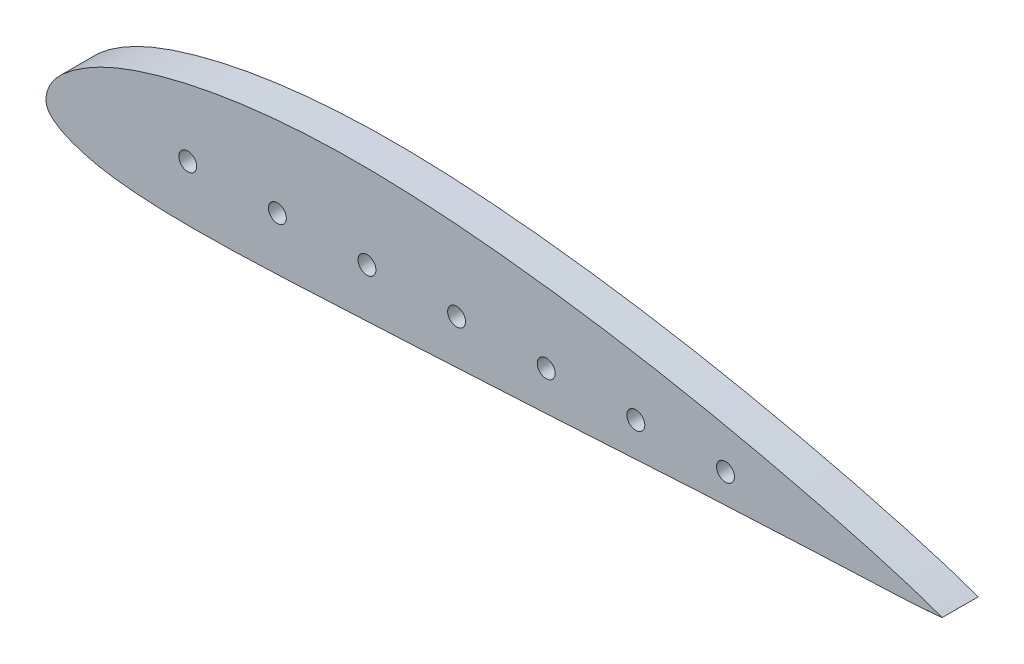
ISO-10303-21;
HEADER;
FILE_DESCRIPTION(('STEP AP214'),'2;1');
FILE_NAME('part.step','',(''),(''),'','','');
FILE_SCHEMA(('AUTOMOTIVE_DESIGN { 1 0 10303 214 1 1 1 1 }'));
ENDSEC;
DATA;
#1=APPLICATION_CONTEXT('core data for automotive mechanical design processes');
#2=APPLICATION_PROTOCOL_DEFINITION('international standard','automotive_design',2000,#1);
#3=PRODUCT_CONTEXT('',#1,'mechanical');
#4=PRODUCT('Part','Part','',(#3));
#5=PRODUCT_RELATED_PRODUCT_CATEGORY('part','',(#4));
#6=PRODUCT_DEFINITION_FORMATION('','',#4);
#7=PRODUCT_DEFINITION_CONTEXT('part definition',#1,'design');
#8=PRODUCT_DEFINITION('design','',#6,#7);
#9=PRODUCT_DEFINITION_SHAPE('','',#8);
#10=(LENGTH_UNIT() NAMED_UNIT(*) SI_UNIT(.MILLI.,.METRE.));
#11=(NAMED_UNIT(*) PLANE_ANGLE_UNIT() SI_UNIT($,.RADIAN.));
#12=(NAMED_UNIT(*) SI_UNIT($,.STERADIAN.) SOLID_ANGLE_UNIT());
#13=UNCERTAINTY_MEASURE_WITH_UNIT(LENGTH_MEASURE(1.E-05),#10,'distance_accuracy_value','');
#14=(GEOMETRIC_REPRESENTATION_CONTEXT(3) GLOBAL_UNCERTAINTY_ASSIGNED_CONTEXT((#13)) GLOBAL_UNIT_ASSIGNED_CONTEXT((#10,
#11,#12)) REPRESENTATION_CONTEXT('',''));
#15=CARTESIAN_POINT('',(0.,0.,0.));
#16=DIRECTION('',(0.,0.,1.));
#17=DIRECTION('',(1.,0.,0.));
#18=AXIS2_PLACEMENT_3D('',#15,#16,#17);
#19=CARTESIAN_POINT('',(109.451798245431,-5.08,5.08));
#20=CARTESIAN_POINT('',(109.454459178744,-5.0694258075468,5.08));
#21=CARTESIAN_POINT('',(109.156485113387,-4.98893370323383,5.08));
#22=CARTESIAN_POINT('',(108.862479978843,-4.85461195717568,5.08));
#23=CARTESIAN_POINT('',(108.123918831792,-4.60117460669964,5.08));
#24=CARTESIAN_POINT('',(107.210252378163,-4.27511376250752,5.08));
#25=CARTESIAN_POINT('',(105.996957401387,-3.86412804078641,5.08));
#26=CARTESIAN_POINT('',(104.53923708378,-3.39638968784611,5.08));
#27=CARTESIAN_POINT('',(102.825319980878,-2.87269416847168,5.08));
#28=CARTESIAN_POINT('',(100.868609031412,-2.30429498547947,5.08));
#29=CARTESIAN_POINT('',(98.677120018108,-1.68869250290389,5.08));
#30=CARTESIAN_POINT('',(96.2607696880802,-1.03022566798201,5.08));
#31=CARTESIAN_POINT('',(93.6287885564061,-0.338112688202309,5.08));
#32=CARTESIAN_POINT('',(90.7922213295436,0.379443625793548,5.08));
#33=CARTESIAN_POINT('',(87.763546501109,1.11431874333265,5.08));
#34=CARTESIAN_POINT('',(84.5564227101674,1.86229543610744,5.08));
#35=CARTESIAN_POINT('',(81.1839302502545,2.61699936289568,5.08));
#36=CARTESIAN_POINT('',(77.6604626634929,3.37053566938624,5.08));
#37=CARTESIAN_POINT('',(74.0010871470234,4.11297119869992,5.08));
#38=CARTESIAN_POINT('',(70.2214341758904,4.83293517068693,5.08));
#39=CARTESIAN_POINT('',(66.3383847064585,5.52614773239327,5.08));
#40=CARTESIAN_POINT('',(62.3677609232154,6.18164020219338,5.08));
#41=CARTESIAN_POINT('',(58.3265125103218,6.79467104657786,5.08));
#42=CARTESIAN_POINT('',(54.2322654270605,7.3581142754929,5.08));
#43=CARTESIAN_POINT('',(50.1022571746908,7.86521701869206,5.08));
#44=CARTESIAN_POINT('',(45.9552044921986,8.314460056631,5.08));
#45=CARTESIAN_POINT('',(41.8078837688901,8.69458239306826,5.08));
#46=CARTESIAN_POINT('',(37.6778363852409,8.99935984883897,5.08));
#47=CARTESIAN_POINT('',(33.5831190485169,9.21958181200142,5.08));
#48=CARTESIAN_POINT('',(29.5409359542949,9.34484403364536,5.08));
#49=CARTESIAN_POINT('',(25.5691488449866,9.36615166551586,5.08));
#50=CARTESIAN_POINT('',(21.6842898563108,9.28357115971868,5.08));
#51=CARTESIAN_POINT('',(17.9029694699595,9.09080508611618,5.08));
#52=CARTESIAN_POINT('',(14.2414370042572,8.7901066249628,5.08));
#53=CARTESIAN_POINT('',(10.7158433347186,8.38653772777966,5.08));
#54=CARTESIAN_POINT('',(7.34129415025395,7.8879080307597,5.08));
#55=CARTESIAN_POINT('',(4.13154087545609,7.30231347263919,5.08));
#56=CARTESIAN_POINT('',(1.10132100092707,6.62948617803047,5.08));
#57=CARTESIAN_POINT('',(-1.73752956384269,5.88532139130179,5.08));
#58=CARTESIAN_POINT('',(-4.37422419748082,5.08138202904439,5.08));
#59=CARTESIAN_POINT('',(-6.79803409663357,4.21512382907975,5.08));
#60=CARTESIAN_POINT('',(-8.99434944048081,3.2765844082489,5.08));
#61=CARTESIAN_POINT('',(-10.9551443346364,2.28063145613607,5.08));
#62=CARTESIAN_POINT('',(-12.6686354294678,1.24621608471318,5.08));
#63=CARTESIAN_POINT('',(-14.1399104434869,0.212705200843522,5.08));
#64=CARTESIAN_POINT('',(-15.3576774886313,-0.820744476133744,5.08));
#65=CARTESIAN_POINT('',(-16.3295875394342,-1.85673893959521,5.08));
#66=CARTESIAN_POINT('',(-17.0202628363783,-2.92281035826037,5.08));
#67=CARTESIAN_POINT('',(-17.4333115493092,-3.96809924516641,5.08));
#68=CARTESIAN_POINT('',(-17.5940544635785,-4.93610308833838,5.08));
#69=CARTESIAN_POINT('',(-17.4702175183407,-5.8088750473589,5.08));
#70=CARTESIAN_POINT('',(-17.0086699305709,-6.54105129294257,5.08));
#71=CARTESIAN_POINT('',(-16.2891353909068,-7.16046076096368,5.08));
#72=CARTESIAN_POINT('',(-15.3346647951794,-7.75507397664849,5.08));
#73=CARTESIAN_POINT('',(-14.1159134721564,-8.30420201060925,5.08));
#74=CARTESIAN_POINT('',(-12.6509130514106,-8.82509795076425,5.08));
#75=CARTESIAN_POINT('',(-10.9336053977492,-9.28593558990606,5.08));
#76=CARTESIAN_POINT('',(-8.97172749068822,-9.66043772730412,5.08));
#77=CARTESIAN_POINT('',(-6.77656462348316,-9.95195932071161,5.08));
#78=CARTESIAN_POINT('',(-4.35740448122734,-10.1686680412697,5.08));
#79=CARTESIAN_POINT('',(-1.72342073780623,-10.3101291264901,5.08));
#80=CARTESIAN_POINT('',(1.11440166995971,-10.3826502445106,5.08));
#81=CARTESIAN_POINT('',(4.14351152847955,-10.3925875239466,5.08));
#82=CARTESIAN_POINT('',(7.35101774838941,-10.3534470410694,5.08));
#83=CARTESIAN_POINT('',(10.7239168059759,-10.264224791165,5.08));
#84=CARTESIAN_POINT('',(14.2476307401474,-10.129211039176,5.08));
#85=CARTESIAN_POINT('',(17.9071565324739,-9.96369874462537,5.08));
#86=CARTESIAN_POINT('',(21.6864453218922,-9.77790103308645,5.08));
#87=CARTESIAN_POINT('',(25.5695768287591,-9.58317083590831,5.08));
#88=CARTESIAN_POINT('',(29.5400512381537,-9.38439462786708,5.08));
#89=CARTESIAN_POINT('',(33.5812406526052,-9.1804648701214,5.08));
#90=CARTESIAN_POINT('',(37.6753635670211,-8.97045350143588,5.08));
#91=CARTESIAN_POINT('',(41.8050014681156,-8.75232303328595,5.08));
#92=CARTESIAN_POINT('',(45.9520094179179,-8.52678932796871,5.08));
#93=CARTESIAN_POINT('',(50.0989896584316,-8.29352213368191,5.08));
#94=CARTESIAN_POINT('',(54.22851261619,-8.05307324658175,5.08));
#95=CARTESIAN_POINT('',(58.3225536689468,-7.81105207853357,5.08));
#96=CARTESIAN_POINT('',(62.3635230482833,-7.5677489493029,5.08));
#97=CARTESIAN_POINT('',(66.3337872257702,-7.33055097205794,5.08));
#98=CARTESIAN_POINT('',(70.2170918118519,-7.10809985442077,5.08));
#99=CARTESIAN_POINT('',(73.9964965572419,-6.89630938119349,5.08));
#100=CARTESIAN_POINT('',(77.6562936872747,-6.70284979119374,5.08));
#101=CARTESIAN_POINT('',(81.1801695815124,-6.52419217673032,5.08));
#102=CARTESIAN_POINT('',(84.5529085687228,-6.35943107843176,5.08));
#103=CARTESIAN_POINT('',(87.7601338312092,-6.20766383934902,5.08));
#104=CARTESIAN_POINT('',(90.7886329934889,-6.06646449572272,5.08));
#105=CARTESIAN_POINT('',(93.6253979865986,-5.93838956358563,5.08));
#106=CARTESIAN_POINT('',(96.2577118500916,-5.82314289841665,5.08));
#107=CARTESIAN_POINT('',(98.6744610539927,-5.71964839534074,5.08));
#108=CARTESIAN_POINT('',(100.865946841829,-5.6315282191389,5.08));
#109=CARTESIAN_POINT('',(102.821934837846,-5.54772865199865,5.08));
#110=CARTESIAN_POINT('',(104.53613188645,-5.46471344288444,5.08));
#111=CARTESIAN_POINT('',(105.994206930004,-5.37725554744643,5.08));
#112=CARTESIAN_POINT('',(107.208082176059,-5.28791450814866,5.08));
#113=CARTESIAN_POINT('',(108.124802464815,-5.20398421107318,5.08));
#114=CARTESIAN_POINT('',(108.85757946549,-5.14653128494667,5.08));
#115=CARTESIAN_POINT('',(109.164058559743,-5.09586083170714,5.08));
#116=CARTESIAN_POINT('',(109.449285024419,-5.08998720356141,5.08));
#117=CARTESIAN_POINT('',(109.451798245431,-5.08,5.08));
#118=B_SPLINE_CURVE_WITH_KNOTS('',3,(#19,#20,#21,#22,#23,#24,#25,#26,#27,#28,#29,#30,#31,#32,
#33,#34,#35,#36,#37,#38,#39,#40,#41,#42,#43,#44,#45,#46,#47,#48,#49,#50,#51,#52,#53,#54,#55,#56,
#57,#58,#59,#60,#61,#62,#63,#64,#65,#66,#67,#68,#69,#70,#71,#72,#73,#74,#75,#76,#77,#78,#79,#80,
#81,#82,#83,#84,#85,#86,#87,#88,#89,#90,#91,#92,#93,#94,#95,#96,#97,#98,#99,#100,#101,#102,#103,
#104,#105,#106,#107,#108,#109,#110,#111,#112,#113,#114,#115,#116,#117),.UNSPECIFIED.,.T.,.F.,(4,
1,1,1,1,1,1,1,1,1,1,1,1,1,1,1,1,1,1,1,1,1,1,1,1,1,1,1,1,1,1,1,1,1,1,1,1,1,1,1,1,1,1,1,1,1,1,1,1,
1,1,1,1,1,1,1,1,1,1,1,1,1,1,1,1,1,1,1,1,1,1,1,1,1,1,1,1,1,1,1,1,1,1,1,1,1,1,1,1,1,1,1,1,1,1,1,
4),(0.,0.000551748168968909,0.00220699267587564,0.00495331783629987,0.00876859672551885,
0.0136237103771035,0.0194917544957015,0.0263313761663127,0.034118237721617,0.042814763955343,
0.0523803885286978,0.062780118387526,0.0739593343954944,0.085864937864062,0.0984463037826211,
0.111647061015066,0.12541472895254,0.139681018693595,0.15437827235737,0.169446877618796,
0.184821177621069,0.200432900996903,0.216223779700666,0.232116858767118,0.248051215843782,
0.263959620823849,0.27977654948636,0.295442408690199,0.310884918055121,0.326054012337802,
0.340892172022955,0.35534852787555,0.369377925346872,0.382929883149188,0.395952713293497,
0.408409584981713,0.420261404507798,0.431467240770188,0.441987752365542,0.451798802150431,
0.460909689796347,0.469303541319367,0.476945895645793,0.483797690745962,0.489858127722002,
0.495197566311554,0.499996833289607,0.504303705219507,0.507974055932029,0.511122506497602,
0.514149355613404,0.517650443947016,0.52191241533645,0.52698225509372,0.532915788027298,
0.539692296023927,0.547308644858914,0.555757425724944,0.565025083316679,0.575098193409434,
0.585939785327677,0.597509158845338,0.609762380674192,0.622648893896746,0.636121864611897,
0.65011775904116,0.664572179415376,0.679425295742404,0.694613250277112,0.710068303100324,
0.725732642993377,0.741529126657818,0.757394896143958,0.773262272158925,0.789063314563828,
0.804734339670543,0.820197409138393,0.835393047804989,0.85025214178361,0.864711863809533,
0.878713432162598,0.892194296731273,0.905091860230497,0.917358005148609,0.928939747527773,
0.939788482525128,0.949855830913999,0.959093409025121,0.967472191854875,0.974954677217858,
0.981503132690762,0.987099408627994,0.991709920982455,0.995322895771173,0.997916481877858,
0.999478880179029,1.),.UNSPECIFIED.);
#119=DIRECTION('',(0.,0.,-1.));
#120=VECTOR('',#119,1.);
#121=SURFACE_OF_LINEAR_EXTRUSION('',#118,#120);
#122=CARTESIAN_POINT('',(109.451798245431,-5.08,5.08));
#123=VERTEX_POINT('',#122);
#124=EDGE_CURVE('E10',#123,#123,#118,.T.);
#125=ORIENTED_EDGE('',*,*,#124,.F.);
#126=EDGE_LOOP('',(#125));
#127=FACE_BOUND('',#126,.T.);
#128=CARTESIAN_POINT('',(109.451798245431,-5.08,0.));
#129=CARTESIAN_POINT('',(109.454459178744,-5.0694258075468,0.));
#130=CARTESIAN_POINT('',(109.156485113387,-4.98893370323383,0.));
#131=CARTESIAN_POINT('',(108.862479978843,-4.85461195717568,0.));
#132=CARTESIAN_POINT('',(108.123918831792,-4.60117460669964,0.));
#133=CARTESIAN_POINT('',(107.210252378163,-4.27511376250752,0.));
#134=CARTESIAN_POINT('',(105.996957401387,-3.86412804078641,0.));
#135=CARTESIAN_POINT('',(104.53923708378,-3.39638968784611,0.));
#136=CARTESIAN_POINT('',(102.825319980878,-2.87269416847168,0.));
#137=CARTESIAN_POINT('',(100.868609031412,-2.30429498547947,0.));
#138=CARTESIAN_POINT('',(98.677120018108,-1.68869250290389,0.));
#139=CARTESIAN_POINT('',(96.2607696880802,-1.03022566798201,0.));
#140=CARTESIAN_POINT('',(93.6287885564061,-0.338112688202309,0.));
#141=CARTESIAN_POINT('',(90.7922213295436,0.379443625793548,0.));
#142=CARTESIAN_POINT('',(87.763546501109,1.11431874333265,0.));
#143=CARTESIAN_POINT('',(84.5564227101674,1.86229543610744,0.));
#144=CARTESIAN_POINT('',(81.1839302502545,2.61699936289568,0.));
#145=CARTESIAN_POINT('',(77.6604626634929,3.37053566938624,0.));
#146=CARTESIAN_POINT('',(74.0010871470234,4.11297119869992,0.));
#147=CARTESIAN_POINT('',(70.2214341758904,4.83293517068693,0.));
#148=CARTESIAN_POINT('',(66.3383847064585,5.52614773239327,0.));
#149=CARTESIAN_POINT('',(62.3677609232154,6.18164020219338,0.));
#150=CARTESIAN_POINT('',(58.3265125103218,6.79467104657786,0.));
#151=CARTESIAN_POINT('',(54.2322654270605,7.3581142754929,0.));
#152=CARTESIAN_POINT('',(50.1022571746908,7.86521701869206,0.));
#153=CARTESIAN_POINT('',(45.9552044921986,8.314460056631,0.));
#154=CARTESIAN_POINT('',(41.8078837688901,8.69458239306826,0.));
#155=CARTESIAN_POINT('',(37.6778363852409,8.99935984883897,0.));
#156=CARTESIAN_POINT('',(33.5831190485169,9.21958181200142,0.));
#157=CARTESIAN_POINT('',(29.5409359542949,9.34484403364536,0.));
#158=CARTESIAN_POINT('',(25.5691488449866,9.36615166551586,0.));
#159=CARTESIAN_POINT('',(21.6842898563108,9.28357115971868,0.));
#160=CARTESIAN_POINT('',(17.9029694699595,9.09080508611618,0.));
#161=CARTESIAN_POINT('',(14.2414370042572,8.7901066249628,0.));
#162=CARTESIAN_POINT('',(10.7158433347186,8.38653772777966,0.));
#163=CARTESIAN_POINT('',(7.34129415025395,7.8879080307597,0.));
#164=CARTESIAN_POINT('',(4.13154087545609,7.30231347263919,0.));
#165=CARTESIAN_POINT('',(1.10132100092707,6.62948617803047,0.));
#166=CARTESIAN_POINT('',(-1.73752956384269,5.88532139130179,0.));
#167=CARTESIAN_POINT('',(-4.37422419748082,5.08138202904439,0.));
#168=CARTESIAN_POINT('',(-6.79803409663357,4.21512382907975,0.));
#169=CARTESIAN_POINT('',(-8.99434944048081,3.2765844082489,0.));
#170=CARTESIAN_POINT('',(-10.9551443346364,2.28063145613607,0.));
#171=CARTESIAN_POINT('',(-12.6686354294678,1.24621608471318,0.));
#172=CARTESIAN_POINT('',(-14.1399104434869,0.212705200843522,0.));
#173=CARTESIAN_POINT('',(-15.3576774886313,-0.820744476133744,0.));
#174=CARTESIAN_POINT('',(-16.3295875394342,-1.85673893959521,0.));
#175=CARTESIAN_POINT('',(-17.0202628363783,-2.92281035826037,0.));
#176=CARTESIAN_POINT('',(-17.4333115493092,-3.96809924516641,0.));
#177=CARTESIAN_POINT('',(-17.5940544635785,-4.93610308833838,0.));
#178=CARTESIAN_POINT('',(-17.4702175183407,-5.8088750473589,0.));
#179=CARTESIAN_POINT('',(-17.0086699305709,-6.54105129294257,0.));
#180=CARTESIAN_POINT('',(-16.2891353909068,-7.16046076096368,0.));
#181=CARTESIAN_POINT('',(-15.3346647951794,-7.75507397664849,0.));
#182=CARTESIAN_POINT('',(-14.1159134721564,-8.30420201060925,0.));
#183=CARTESIAN_POINT('',(-12.6509130514106,-8.82509795076425,0.));
#184=CARTESIAN_POINT('',(-10.9336053977492,-9.28593558990606,0.));
#185=CARTESIAN_POINT('',(-8.97172749068822,-9.66043772730412,0.));
#186=CARTESIAN_POINT('',(-6.77656462348316,-9.95195932071161,0.));
#187=CARTESIAN_POINT('',(-4.35740448122734,-10.1686680412697,0.));
#188=CARTESIAN_POINT('',(-1.72342073780623,-10.3101291264901,0.));
#189=CARTESIAN_POINT('',(1.11440166995971,-10.3826502445106,0.));
#190=CARTESIAN_POINT('',(4.14351152847955,-10.3925875239466,0.));
#191=CARTESIAN_POINT('',(7.35101774838941,-10.3534470410694,0.));
#192=CARTESIAN_POINT('',(10.7239168059759,-10.264224791165,0.));
#193=CARTESIAN_POINT('',(14.2476307401474,-10.129211039176,0.));
#194=CARTESIAN_POINT('',(17.9071565324739,-9.96369874462537,0.));
#195=CARTESIAN_POINT('',(21.6864453218922,-9.77790103308645,0.));
#196=CARTESIAN_POINT('',(25.5695768287591,-9.58317083590831,0.));
#197=CARTESIAN_POINT('',(29.5400512381537,-9.38439462786708,0.));
#198=CARTESIAN_POINT('',(33.5812406526052,-9.1804648701214,0.));
#199=CARTESIAN_POINT('',(37.6753635670211,-8.97045350143588,0.));
#200=CARTESIAN_POINT('',(41.8050014681156,-8.75232303328595,0.));
#201=CARTESIAN_POINT('',(45.9520094179179,-8.52678932796871,0.));
#202=CARTESIAN_POINT('',(50.0989896584316,-8.29352213368191,0.));
#203=CARTESIAN_POINT('',(54.22851261619,-8.05307324658175,0.));
#204=CARTESIAN_POINT('',(58.3225536689468,-7.81105207853357,0.));
#205=CARTESIAN_POINT('',(62.3635230482833,-7.5677489493029,0.));
#206=CARTESIAN_POINT('',(66.3337872257702,-7.33055097205794,0.));
#207=CARTESIAN_POINT('',(70.2170918118519,-7.10809985442077,0.));
#208=CARTESIAN_POINT('',(73.9964965572419,-6.89630938119349,0.));
#209=CARTESIAN_POINT('',(77.6562936872747,-6.70284979119374,0.));
#210=CARTESIAN_POINT('',(81.1801695815124,-6.52419217673032,0.));
#211=CARTESIAN_POINT('',(84.5529085687228,-6.35943107843176,0.));
#212=CARTESIAN_POINT('',(87.7601338312092,-6.20766383934902,0.));
#213=CARTESIAN_POINT('',(90.7886329934889,-6.06646449572272,0.));
#214=CARTESIAN_POINT('',(93.6253979865986,-5.93838956358563,0.));
#215=CARTESIAN_POINT('',(96.2577118500916,-5.82314289841665,0.));
#216=CARTESIAN_POINT('',(98.6744610539927,-5.71964839534074,0.));
#217=CARTESIAN_POINT('',(100.865946841829,-5.6315282191389,0.));
#218=CARTESIAN_POINT('',(102.821934837846,-5.54772865199865,0.));
#219=CARTESIAN_POINT('',(104.53613188645,-5.46471344288444,0.));
#220=CARTESIAN_POINT('',(105.994206930004,-5.37725554744643,0.));
#221=CARTESIAN_POINT('',(107.208082176059,-5.28791450814866,0.));
#222=CARTESIAN_POINT('',(108.124802464815,-5.20398421107318,0.));
#223=CARTESIAN_POINT('',(108.85757946549,-5.14653128494667,0.));
#224=CARTESIAN_POINT('',(109.164058559743,-5.09586083170714,0.));
#225=CARTESIAN_POINT('',(109.449285024419,-5.08998720356141,0.));
#226=CARTESIAN_POINT('',(109.451798245431,-5.08,0.));
#227=B_SPLINE_CURVE_WITH_KNOTS('',3,(#128,#129,#130,#131,#132,#133,#134,#135,#136,#137,#138,
#139,#140,#141,#142,#143,#144,#145,#146,#147,#148,#149,#150,#151,#152,#153,#154,#155,#156,#157,
#158,#159,#160,#161,#162,#163,#164,#165,#166,#167,#168,#169,#170,#171,#172,#173,#174,#175,#176,
#177,#178,#179,#180,#181,#182,#183,#184,#185,#186,#187,#188,#189,#190,#191,#192,#193,#194,#195,
#196,#197,#198,#199,#200,#201,#202,#203,#204,#205,#206,#207,#208,#209,#210,#211,#212,#213,#214,
#215,#216,#217,#218,#219,#220,#221,#222,#223,#224,#225,#226),.UNSPECIFIED.,.T.,.F.,(4,1,1,1,1,1,
1,1,1,1,1,1,1,1,1,1,1,1,1,1,1,1,1,1,1,1,1,1,1,1,1,1,1,1,1,1,1,1,1,1,1,1,1,1,1,1,1,1,1,1,1,1,1,1,
1,1,1,1,1,1,1,1,1,1,1,1,1,1,1,1,1,1,1,1,1,1,1,1,1,1,1,1,1,1,1,1,1,1,1,1,1,1,1,1,1,1,4),(0.,
0.000551748168968909,0.00220699267587564,0.00495331783629987,0.00876859672551885,
0.0136237103771035,0.0194917544957015,0.0263313761663127,0.034118237721617,0.042814763955343,
0.0523803885286978,0.062780118387526,0.0739593343954944,0.085864937864062,0.0984463037826211,
0.111647061015066,0.12541472895254,0.139681018693595,0.15437827235737,0.169446877618796,
0.184821177621069,0.200432900996903,0.216223779700666,0.232116858767118,0.248051215843782,
0.263959620823849,0.27977654948636,0.295442408690199,0.310884918055121,0.326054012337802,
0.340892172022955,0.35534852787555,0.369377925346872,0.382929883149188,0.395952713293497,
0.408409584981713,0.420261404507798,0.431467240770188,0.441987752365542,0.451798802150431,
0.460909689796347,0.469303541319367,0.476945895645793,0.483797690745962,0.489858127722002,
0.495197566311554,0.499996833289607,0.504303705219507,0.507974055932029,0.511122506497602,
0.514149355613404,0.517650443947016,0.52191241533645,0.52698225509372,0.532915788027298,
0.539692296023927,0.547308644858914,0.555757425724944,0.565025083316679,0.575098193409434,
0.585939785327677,0.597509158845338,0.609762380674192,0.622648893896746,0.636121864611897,
0.65011775904116,0.664572179415376,0.679425295742404,0.694613250277112,0.710068303100324,
0.725732642993377,0.741529126657818,0.757394896143958,0.773262272158925,0.789063314563828,
0.804734339670543,0.820197409138393,0.835393047804989,0.85025214178361,0.864711863809533,
0.878713432162598,0.892194296731273,0.905091860230497,0.917358005148609,0.928939747527773,
0.939788482525128,0.949855830913999,0.959093409025121,0.967472191854875,0.974954677217858,
0.981503132690762,0.987099408627994,0.991709920982455,0.995322895771173,0.997916481877858,
0.999478880179029,1.),.UNSPECIFIED.);
#228=CARTESIAN_POINT('',(109.451798245431,-5.08,0.));
#229=VERTEX_POINT('',#228);
#230=EDGE_CURVE('E37',#229,#229,#227,.T.);
#231=ORIENTED_EDGE('',*,*,#230,.T.);
#232=EDGE_LOOP('',(#231));
#233=FACE_BOUND('',#232,.T.);
#234=ADVANCED_FACE('F33',(#127,#233),#121,.F.);
#235=CARTESIAN_POINT('',(-17.005018401707,-2.98016125510176,5.08));
#236=DIRECTION('',(0.,0.,-1.));
#237=DIRECTION('',(-1.,0.,0.));
#238=AXIS2_PLACEMENT_3D('',#235,#236,#237);
#239=PLANE('',#238);
#240=CARTESIAN_POINT('',(2.54,-2.54,5.08));
#241=DIRECTION('',(0.,0.,1.));
#242=DIRECTION('',(1.,0.,0.));
#243=AXIS2_PLACEMENT_3D('',#240,#241,#242);
#244=CIRCLE('',#243,1.27);
#245=CARTESIAN_POINT('',(3.81,-2.54,5.08));
#246=VERTEX_POINT('',#245);
#247=EDGE_CURVE('E76',#246,#246,#244,.T.);
#248=ORIENTED_EDGE('',*,*,#247,.F.);
#249=EDGE_LOOP('',(#248));
#250=FACE_BOUND('',#249,.T.);
#251=CARTESIAN_POINT('',(40.64,-2.54,5.08));
#252=DIRECTION('',(0.,0.,1.));
#253=DIRECTION('',(1.,0.,0.));
#254=AXIS2_PLACEMENT_3D('',#251,#252,#253);
#255=CIRCLE('',#254,1.27);
#256=CARTESIAN_POINT('',(41.91,-2.54,5.08));
#257=VERTEX_POINT('',#256);
#258=EDGE_CURVE('E83',#257,#257,#255,.T.);
#259=ORIENTED_EDGE('',*,*,#258,.F.);
#260=EDGE_LOOP('',(#259));
#261=FACE_BOUND('',#260,.T.);
#262=CARTESIAN_POINT('',(66.04,-2.54,5.08));
#263=DIRECTION('',(0.,0.,1.));
#264=DIRECTION('',(1.,0.,0.));
#265=AXIS2_PLACEMENT_3D('',#262,#263,#264);
#266=CIRCLE('',#265,1.26999999999999);
#267=CARTESIAN_POINT('',(67.31,-2.54,5.08));
#268=VERTEX_POINT('',#267);
#269=EDGE_CURVE('E82',#268,#268,#266,.T.);
#270=ORIENTED_EDGE('',*,*,#269,.F.);
#271=EDGE_LOOP('',(#270));
#272=FACE_BOUND('',#271,.T.);
#273=CARTESIAN_POINT('',(78.74,-2.54,5.08));
#274=DIRECTION('',(0.,0.,1.));
#275=DIRECTION('',(1.,0.,0.));
#276=AXIS2_PLACEMENT_3D('',#273,#274,#275);
#277=CIRCLE('',#276,1.26999999999999);
#278=CARTESIAN_POINT('',(80.01,-2.54,5.08));
#279=VERTEX_POINT('',#278);
#280=EDGE_CURVE('E57',#279,#279,#277,.T.);
#281=ORIENTED_EDGE('',*,*,#280,.F.);
#282=EDGE_LOOP('',(#281));
#283=FACE_BOUND('',#282,.T.);
#284=CARTESIAN_POINT('',(53.34,-2.54,5.08));
#285=DIRECTION('',(0.,0.,1.));
#286=DIRECTION('',(1.,0.,0.));
#287=AXIS2_PLACEMENT_3D('',#284,#285,#286);
#288=CIRCLE('',#287,1.27);
#289=CARTESIAN_POINT('',(54.61,-2.54,5.08));
#290=VERTEX_POINT('',#289);
#291=EDGE_CURVE('E56',#290,#290,#288,.T.);
#292=ORIENTED_EDGE('',*,*,#291,.F.);
#293=EDGE_LOOP('',(#292));
#294=FACE_BOUND('',#293,.T.);
#295=CARTESIAN_POINT('',(27.94,-2.54,5.08));
#296=DIRECTION('',(0.,0.,1.));
#297=DIRECTION('',(1.,0.,0.));
#298=AXIS2_PLACEMENT_3D('',#295,#296,#297);
#299=CIRCLE('',#298,1.27);
#300=CARTESIAN_POINT('',(29.21,-2.54,5.08));
#301=VERTEX_POINT('',#300);
#302=EDGE_CURVE('E64',#301,#301,#299,.T.);
#303=ORIENTED_EDGE('',*,*,#302,.F.);
#304=EDGE_LOOP('',(#303));
#305=FACE_BOUND('',#304,.T.);
#306=CARTESIAN_POINT('',(15.24,-2.54,5.08));
#307=DIRECTION('',(0.,0.,1.));
#308=DIRECTION('',(1.,0.,0.));
#309=AXIS2_PLACEMENT_3D('',#306,#307,#308);
#310=CIRCLE('',#309,1.27);
#311=CARTESIAN_POINT('',(16.51,-2.54,5.08));
#312=VERTEX_POINT('',#311);
#313=EDGE_CURVE('E70',#312,#312,#310,.T.);
#314=ORIENTED_EDGE('',*,*,#313,.F.);
#315=EDGE_LOOP('',(#314));
#316=FACE_BOUND('',#315,.T.);
#317=ORIENTED_EDGE('',*,*,#124,.T.);
#318=EDGE_LOOP('',(#317));
#319=FACE_BOUND('',#318,.T.);
#320=ADVANCED_FACE('F98',(#250,#261,#272,#283,#294,#305,#316,#319),#239,.F.);
#321=CARTESIAN_POINT('',(-17.005018401707,-2.98016125510176,0.));
#322=DIRECTION('',(0.,0.,-1.));
#323=DIRECTION('',(-1.,0.,0.));
#324=AXIS2_PLACEMENT_3D('',#321,#322,#323);
#325=PLANE('',#324);
#326=CARTESIAN_POINT('',(2.54,-2.54,0.));
#327=DIRECTION('',(0.,0.,-1.));
#328=DIRECTION('',(-1.,0.,0.));
#329=AXIS2_PLACEMENT_3D('',#326,#327,#328);
#330=CIRCLE('',#329,1.27);
#331=CARTESIAN_POINT('',(1.27,-2.54,0.));
#332=VERTEX_POINT('',#331);
#333=EDGE_CURVE('E45',#332,#332,#330,.F.);
#334=ORIENTED_EDGE('',*,*,#333,.T.);
#335=EDGE_LOOP('',(#334));
#336=FACE_BOUND('',#335,.T.);
#337=CARTESIAN_POINT('',(40.64,-2.54,0.));
#338=DIRECTION('',(0.,0.,-1.));
#339=DIRECTION('',(-1.,0.,0.));
#340=AXIS2_PLACEMENT_3D('',#337,#338,#339);
#341=CIRCLE('',#340,1.27);
#342=CARTESIAN_POINT('',(39.37,-2.54,0.));
#343=VERTEX_POINT('',#342);
#344=EDGE_CURVE('E79',#343,#343,#341,.F.);
#345=ORIENTED_EDGE('',*,*,#344,.T.);
#346=EDGE_LOOP('',(#345));
#347=FACE_BOUND('',#346,.T.);
#348=CARTESIAN_POINT('',(66.04,-2.54,0.));
#349=DIRECTION('',(0.,0.,-1.));
#350=DIRECTION('',(-1.,0.,0.));
#351=AXIS2_PLACEMENT_3D('',#348,#349,#350);
#352=CIRCLE('',#351,1.26999999999999);
#353=CARTESIAN_POINT('',(64.77,-2.54,0.));
#354=VERTEX_POINT('',#353);
#355=EDGE_CURVE('E60',#354,#354,#352,.F.);
#356=ORIENTED_EDGE('',*,*,#355,.T.);
#357=EDGE_LOOP('',(#356));
#358=FACE_BOUND('',#357,.T.);
#359=CARTESIAN_POINT('',(78.74,-2.54,0.));
#360=DIRECTION('',(0.,0.,-1.));
#361=DIRECTION('',(-1.,0.,0.));
#362=AXIS2_PLACEMENT_3D('',#359,#360,#361);
#363=CIRCLE('',#362,1.26999999999999);
#364=CARTESIAN_POINT('',(77.47,-2.54,0.));
#365=VERTEX_POINT('',#364);
#366=EDGE_CURVE('E50',#365,#365,#363,.F.);
#367=ORIENTED_EDGE('',*,*,#366,.T.);
#368=EDGE_LOOP('',(#367));
#369=FACE_BOUND('',#368,.T.);
#370=CARTESIAN_POINT('',(53.34,-2.54,0.));
#371=DIRECTION('',(0.,0.,-1.));
#372=DIRECTION('',(-1.,0.,0.));
#373=AXIS2_PLACEMENT_3D('',#370,#371,#372);
#374=CIRCLE('',#373,1.27);
#375=CARTESIAN_POINT('',(52.07,-2.54,0.));
#376=VERTEX_POINT('',#375);
#377=EDGE_CURVE('E61',#376,#376,#374,.F.);
#378=ORIENTED_EDGE('',*,*,#377,.T.);
#379=EDGE_LOOP('',(#378));
#380=FACE_BOUND('',#379,.T.);
#381=CARTESIAN_POINT('',(27.94,-2.54,0.));
#382=DIRECTION('',(0.,0.,-1.));
#383=DIRECTION('',(-1.,0.,0.));
#384=AXIS2_PLACEMENT_3D('',#381,#382,#383);
#385=CIRCLE('',#384,1.27);
#386=CARTESIAN_POINT('',(26.67,-2.54,0.));
#387=VERTEX_POINT('',#386);
#388=EDGE_CURVE('E67',#387,#387,#385,.F.);
#389=ORIENTED_EDGE('',*,*,#388,.T.);
#390=EDGE_LOOP('',(#389));
#391=FACE_BOUND('',#390,.T.);
#392=CARTESIAN_POINT('',(15.24,-2.54,0.));
#393=DIRECTION('',(0.,0.,-1.));
#394=DIRECTION('',(-1.,0.,0.));
#395=AXIS2_PLACEMENT_3D('',#392,#393,#394);
#396=CIRCLE('',#395,1.27);
#397=CARTESIAN_POINT('',(13.97,-2.54,0.));
#398=VERTEX_POINT('',#397);
#399=EDGE_CURVE('E73',#398,#398,#396,.F.);
#400=ORIENTED_EDGE('',*,*,#399,.T.);
#401=EDGE_LOOP('',(#400));
#402=FACE_BOUND('',#401,.T.);
#403=ORIENTED_EDGE('',*,*,#230,.F.);
#404=EDGE_LOOP('',(#403));
#405=FACE_BOUND('',#404,.T.);
#406=ADVANCED_FACE('F101',(#336,#347,#358,#369,#380,#391,#402,#405),#325,.T.);
#407=CARTESIAN_POINT('',(15.24,-2.54,-3.59210244842766));
#408=DIRECTION('',(0.,0.,1.));
#409=DIRECTION('',(1.,0.,0.));
#410=AXIS2_PLACEMENT_3D('',#407,#408,#409);
#411=CYLINDRICAL_SURFACE('',#410,1.27);
#412=ORIENTED_EDGE('',*,*,#313,.T.);
#413=EDGE_LOOP('',(#412));
#414=FACE_BOUND('',#413,.T.);
#415=ORIENTED_EDGE('',*,*,#399,.F.);
#416=EDGE_LOOP('',(#415));
#417=FACE_BOUND('',#416,.T.);
#418=ADVANCED_FACE('F115',(#414,#417),#411,.F.);
#419=CARTESIAN_POINT('',(27.94,-2.54,-3.59210244842766));
#420=DIRECTION('',(0.,0.,1.));
#421=DIRECTION('',(1.,0.,0.));
#422=AXIS2_PLACEMENT_3D('',#419,#420,#421);
#423=CYLINDRICAL_SURFACE('',#422,1.27);
#424=ORIENTED_EDGE('',*,*,#302,.T.);
#425=EDGE_LOOP('',(#424));
#426=FACE_BOUND('',#425,.T.);
#427=ORIENTED_EDGE('',*,*,#388,.F.);
#428=EDGE_LOOP('',(#427));
#429=FACE_BOUND('',#428,.T.);
#430=ADVANCED_FACE('F118',(#426,#429),#423,.F.);
#431=CARTESIAN_POINT('',(53.34,-2.54,-3.59210244842766));
#432=DIRECTION('',(0.,0.,1.));
#433=DIRECTION('',(1.,0.,0.));
#434=AXIS2_PLACEMENT_3D('',#431,#432,#433);
#435=CYLINDRICAL_SURFACE('',#434,1.27);
#436=ORIENTED_EDGE('',*,*,#291,.T.);
#437=EDGE_LOOP('',(#436));
#438=FACE_BOUND('',#437,.T.);
#439=ORIENTED_EDGE('',*,*,#377,.F.);
#440=EDGE_LOOP('',(#439));
#441=FACE_BOUND('',#440,.T.);
#442=ADVANCED_FACE('F149',(#438,#441),#435,.F.);
#443=CARTESIAN_POINT('',(78.74,-2.54,-3.59210244842766));
#444=DIRECTION('',(0.,0.,1.));
#445=DIRECTION('',(1.,0.,0.));
#446=AXIS2_PLACEMENT_3D('',#443,#444,#445);
#447=CYLINDRICAL_SURFACE('',#446,1.26999999999999);
#448=ORIENTED_EDGE('',*,*,#280,.T.);
#449=EDGE_LOOP('',(#448));
#450=FACE_BOUND('',#449,.T.);
#451=ORIENTED_EDGE('',*,*,#366,.F.);
#452=EDGE_LOOP('',(#451));
#453=FACE_BOUND('',#452,.T.);
#454=ADVANCED_FACE('F157',(#450,#453),#447,.F.);
#455=CARTESIAN_POINT('',(66.04,-2.54,-3.59210244842766));
#456=DIRECTION('',(0.,0.,1.));
#457=DIRECTION('',(1.,0.,0.));
#458=AXIS2_PLACEMENT_3D('',#455,#456,#457);
#459=CYLINDRICAL_SURFACE('',#458,1.26999999999999);
#460=ORIENTED_EDGE('',*,*,#269,.T.);
#461=EDGE_LOOP('',(#460));
#462=FACE_BOUND('',#461,.T.);
#463=ORIENTED_EDGE('',*,*,#355,.F.);
#464=EDGE_LOOP('',(#463));
#465=FACE_BOUND('',#464,.T.);
#466=ADVANCED_FACE('F165',(#462,#465),#459,.F.);
#467=CARTESIAN_POINT('',(40.64,-2.54,-3.59210244842766));
#468=DIRECTION('',(0.,0.,1.));
#469=DIRECTION('',(1.,0.,0.));
#470=AXIS2_PLACEMENT_3D('',#467,#468,#469);
#471=CYLINDRICAL_SURFACE('',#470,1.27);
#472=ORIENTED_EDGE('',*,*,#258,.T.);
#473=EDGE_LOOP('',(#472));
#474=FACE_BOUND('',#473,.T.);
#475=ORIENTED_EDGE('',*,*,#344,.F.);
#476=EDGE_LOOP('',(#475));
#477=FACE_BOUND('',#476,.T.);
#478=ADVANCED_FACE('F173',(#474,#477),#471,.F.);
#479=CARTESIAN_POINT('',(2.54,-2.54,-3.59210244842766));
#480=DIRECTION('',(0.,0.,1.));
#481=DIRECTION('',(1.,0.,0.));
#482=AXIS2_PLACEMENT_3D('',#479,#480,#481);
#483=CYLINDRICAL_SURFACE('',#482,1.27);
#484=ORIENTED_EDGE('',*,*,#247,.T.);
#485=EDGE_LOOP('',(#484));
#486=FACE_BOUND('',#485,.T.);
#487=ORIENTED_EDGE('',*,*,#333,.F.);
#488=EDGE_LOOP('',(#487));
#489=FACE_BOUND('',#488,.T.);
#490=ADVANCED_FACE('F95',(#486,#489),#483,.F.);
#491=CLOSED_SHELL('',(#234,#320,#406,#418,#430,#442,#454,#466,#478,#490));
#492=MANIFOLD_SOLID_BREP('B2',#491);
#493=ADVANCED_BREP_SHAPE_REPRESENTATION('',(#18,#492),#14);
#494=SHAPE_DEFINITION_REPRESENTATION(#9,#493);
ENDSEC;
END-ISO-10303-21;
